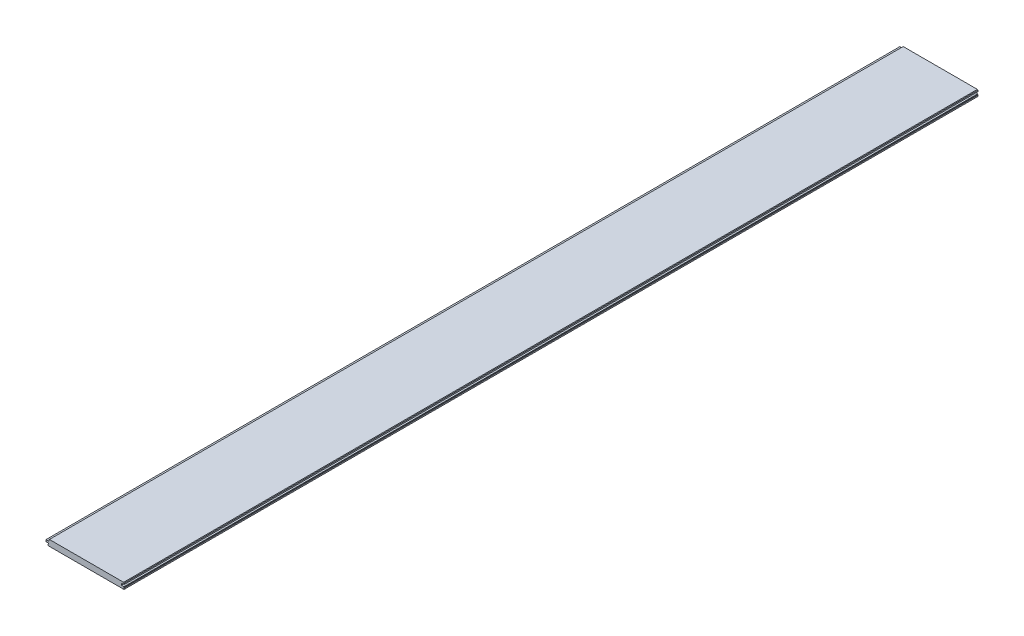
ISO-10303-21;
HEADER;
FILE_DESCRIPTION(('STEP AP214'),'2;1');
FILE_NAME('part.step','',(''),(''),'','','');
FILE_SCHEMA(('AUTOMOTIVE_DESIGN { 1 0 10303 214 1 1 1 1 }'));
ENDSEC;
DATA;
#1=APPLICATION_CONTEXT('core data for automotive mechanical design processes');
#2=APPLICATION_PROTOCOL_DEFINITION('international standard','automotive_design',2000,#1);
#3=PRODUCT_CONTEXT('',#1,'mechanical');
#4=PRODUCT('Part','Part','',(#3));
#5=PRODUCT_RELATED_PRODUCT_CATEGORY('part','',(#4));
#6=PRODUCT_DEFINITION_FORMATION('','',#4);
#7=PRODUCT_DEFINITION_CONTEXT('part definition',#1,'design');
#8=PRODUCT_DEFINITION('design','',#6,#7);
#9=PRODUCT_DEFINITION_SHAPE('','',#8);
#10=(LENGTH_UNIT() NAMED_UNIT(*) SI_UNIT(.MILLI.,.METRE.));
#11=(NAMED_UNIT(*) PLANE_ANGLE_UNIT() SI_UNIT($,.RADIAN.));
#12=(NAMED_UNIT(*) SI_UNIT($,.STERADIAN.) SOLID_ANGLE_UNIT());
#13=UNCERTAINTY_MEASURE_WITH_UNIT(LENGTH_MEASURE(1.E-05),#10,'distance_accuracy_value','');
#14=(GEOMETRIC_REPRESENTATION_CONTEXT(3) GLOBAL_UNCERTAINTY_ASSIGNED_CONTEXT((#13)) GLOBAL_UNIT_ASSIGNED_CONTEXT((#10,
#11,#12)) REPRESENTATION_CONTEXT('',''));
#15=CARTESIAN_POINT('',(0.,0.,0.));
#16=DIRECTION('',(0.,0.,1.));
#17=DIRECTION('',(1.,0.,0.));
#18=AXIS2_PLACEMENT_3D('',#15,#16,#17);
#19=CARTESIAN_POINT('',(94.83725,0.,1066.8));
#20=DIRECTION('',(-1.,0.,0.));
#21=DIRECTION('',(0.,0.,1.));
#22=AXIS2_PLACEMENT_3D('',#19,#20,#21);
#23=PLANE('',#22);
#24=DIRECTION('',(0.,1.,0.));
#25=VECTOR('',#24,1.);
#26=CARTESIAN_POINT('',(94.83725,0.,-1066.8));
#27=LINE('',#26,#25);
#28=CARTESIAN_POINT('',(94.83725,3.12419999999999,-1066.8));
#29=VERTEX_POINT('',#28);
#30=CARTESIAN_POINT('',(94.83725,6.28649999999999,-1066.8));
#31=VERTEX_POINT('',#30);
#32=EDGE_CURVE('E206',#29,#31,#27,.T.);
#33=ORIENTED_EDGE('',*,*,#32,.T.);
#34=DIRECTION('',(0.,0.,-1.));
#35=VECTOR('',#34,1.);
#36=CARTESIAN_POINT('',(94.83725,6.28649999999999,1066.8));
#37=LINE('',#36,#35);
#38=CARTESIAN_POINT('',(94.83725,6.28649999999999,1066.8));
#39=VERTEX_POINT('',#38);
#40=EDGE_CURVE('E11',#39,#31,#37,.T.);
#41=ORIENTED_EDGE('',*,*,#40,.F.);
#42=DIRECTION('',(0.,1.,0.));
#43=VECTOR('',#42,1.);
#44=CARTESIAN_POINT('',(94.83725,0.,1066.8));
#45=LINE('',#44,#43);
#46=CARTESIAN_POINT('',(94.83725,3.12419999999999,1066.8));
#47=VERTEX_POINT('',#46);
#48=EDGE_CURVE('E256',#47,#39,#45,.T.);
#49=ORIENTED_EDGE('',*,*,#48,.F.);
#50=DIRECTION('',(0.,0.,-1.));
#51=VECTOR('',#50,1.);
#52=CARTESIAN_POINT('',(94.83725,3.12419999999999,1066.8));
#53=LINE('',#52,#51);
#54=EDGE_CURVE('E53',#47,#29,#53,.T.);
#55=ORIENTED_EDGE('',*,*,#54,.T.);
#56=EDGE_LOOP('',(#33,#41,#49,#55));
#57=FACE_BOUND('',#56,.T.);
#58=ADVANCED_FACE('F37',(#57),#23,.F.);
#59=CARTESIAN_POINT('',(50.5618749999997,50.561875,1066.8));
#60=DIRECTION('',(-0.707106781186545,-0.707106781186549,0.));
#61=DIRECTION('',(0.70710678118655,-0.707106781186546,0.));
#62=AXIS2_PLACEMENT_3D('',#59,#60,#61);
#63=PLANE('',#62);
#64=DIRECTION('',(-0.70710678118655,0.707106781186546,0.));
#65=VECTOR('',#64,1.);
#66=CARTESIAN_POINT('',(50.5618749999997,50.561875,-1066.8));
#67=LINE('',#66,#65);
#68=CARTESIAN_POINT('',(93.56725,7.55649999999999,-1066.8));
#69=VERTEX_POINT('',#68);
#70=EDGE_CURVE('E208',#31,#69,#67,.T.);
#71=ORIENTED_EDGE('',*,*,#70,.T.);
#72=DIRECTION('',(0.,0.,-1.));
#73=VECTOR('',#72,1.);
#74=CARTESIAN_POINT('',(93.56725,7.55649999999999,1066.8));
#75=LINE('',#74,#73);
#76=CARTESIAN_POINT('',(93.56725,7.55649999999999,1066.8));
#77=VERTEX_POINT('',#76);
#78=EDGE_CURVE('E45',#77,#69,#75,.T.);
#79=ORIENTED_EDGE('',*,*,#78,.F.);
#80=DIRECTION('',(-0.70710678118655,0.707106781186546,0.));
#81=VECTOR('',#80,1.);
#82=CARTESIAN_POINT('',(50.5618749999997,50.561875,1066.8));
#83=LINE('',#82,#81);
#84=EDGE_CURVE('E127',#39,#77,#83,.T.);
#85=ORIENTED_EDGE('',*,*,#84,.F.);
#86=ORIENTED_EDGE('',*,*,#40,.T.);
#87=EDGE_LOOP('',(#71,#79,#85,#86));
#88=FACE_BOUND('',#87,.T.);
#89=ADVANCED_FACE('F299',(#88),#63,.F.);
#90=CARTESIAN_POINT('',(0.,7.55649999999999,1066.8));
#91=DIRECTION('',(0.,1.,0.));
#92=DIRECTION('',(0.,0.,1.));
#93=AXIS2_PLACEMENT_3D('',#90,#91,#92);
#94=PLANE('',#93);
#95=DIRECTION('',(1.,0.,0.));
#96=VECTOR('',#95,1.);
#97=CARTESIAN_POINT('',(0.,7.55649999999999,-1066.8));
#98=LINE('',#97,#96);
#99=CARTESIAN_POINT('',(-91.86545,7.55649999999999,-1066.8));
#100=VERTEX_POINT('',#99);
#101=EDGE_CURVE('E211',#100,#69,#98,.T.);
#102=ORIENTED_EDGE('',*,*,#101,.F.);
#103=DIRECTION('',(0.,0.,-1.));
#104=VECTOR('',#103,1.);
#105=CARTESIAN_POINT('',(-91.86545,7.55649999999999,1066.8));
#106=LINE('',#105,#104);
#107=CARTESIAN_POINT('',(-91.86545,7.55649999999999,1066.8));
#108=VERTEX_POINT('',#107);
#109=EDGE_CURVE('E292',#108,#100,#106,.T.);
#110=ORIENTED_EDGE('',*,*,#109,.F.);
#111=DIRECTION('',(1.,0.,0.));
#112=VECTOR('',#111,1.);
#113=CARTESIAN_POINT('',(0.,7.55649999999999,1066.8));
#114=LINE('',#113,#112);
#115=EDGE_CURVE('E298',#108,#77,#114,.T.);
#116=ORIENTED_EDGE('',*,*,#115,.T.);
#117=ORIENTED_EDGE('',*,*,#78,.T.);
#118=EDGE_LOOP('',(#102,#110,#116,#117));
#119=FACE_BOUND('',#118,.T.);
#120=ADVANCED_FACE('F296',(#119),#94,.T.);
#121=CARTESIAN_POINT('',(-49.7109749999998,49.710975,1066.8));
#122=DIRECTION('',(-0.707106781186545,0.707106781186549,0.));
#123=DIRECTION('',(-0.70710678118655,-0.707106781186546,0.));
#124=AXIS2_PLACEMENT_3D('',#121,#122,#123);
#125=PLANE('',#124);
#126=DIRECTION('',(0.70710678118655,0.707106781186546,0.));
#127=VECTOR('',#126,1.);
#128=CARTESIAN_POINT('',(-49.7109749999998,49.710975,-1066.8));
#129=LINE('',#128,#127);
#130=CARTESIAN_POINT('',(-93.13545,6.28649999999998,-1066.8));
#131=VERTEX_POINT('',#130);
#132=EDGE_CURVE('E214',#131,#100,#129,.T.);
#133=ORIENTED_EDGE('',*,*,#132,.F.);
#134=DIRECTION('',(0.,0.,-1.));
#135=VECTOR('',#134,1.);
#136=CARTESIAN_POINT('',(-93.13545,6.28649999999998,1066.8));
#137=LINE('',#136,#135);
#138=CARTESIAN_POINT('',(-93.13545,6.28649999999998,1066.8));
#139=VERTEX_POINT('',#138);
#140=EDGE_CURVE('E290',#139,#131,#137,.T.);
#141=ORIENTED_EDGE('',*,*,#140,.F.);
#142=DIRECTION('',(0.70710678118655,0.707106781186546,0.));
#143=VECTOR('',#142,1.);
#144=CARTESIAN_POINT('',(-49.7109749999998,49.710975,1066.8));
#145=LINE('',#144,#143);
#146=EDGE_CURVE('E310',#139,#108,#145,.T.);
#147=ORIENTED_EDGE('',*,*,#146,.T.);
#148=ORIENTED_EDGE('',*,*,#109,.T.);
#149=EDGE_LOOP('',(#133,#141,#147,#148));
#150=FACE_BOUND('',#149,.T.);
#151=ADVANCED_FACE('F307',(#150),#125,.T.);
#152=CARTESIAN_POINT('',(-93.13545,0.,1066.8));
#153=DIRECTION('',(-1.,0.,0.));
#154=DIRECTION('',(0.,0.,1.));
#155=AXIS2_PLACEMENT_3D('',#152,#153,#154);
#156=PLANE('',#155);
#157=DIRECTION('',(0.,1.,0.));
#158=VECTOR('',#157,1.);
#159=CARTESIAN_POINT('',(-93.13545,0.,-1066.8));
#160=LINE('',#159,#158);
#161=CARTESIAN_POINT('',(-93.13545,2.98449999999999,-1066.8));
#162=VERTEX_POINT('',#161);
#163=EDGE_CURVE('E217',#162,#131,#160,.T.);
#164=ORIENTED_EDGE('',*,*,#163,.F.);
#165=DIRECTION('',(0.,0.,-1.));
#166=VECTOR('',#165,1.);
#167=CARTESIAN_POINT('',(-93.13545,2.98449999999999,1066.8));
#168=LINE('',#167,#166);
#169=CARTESIAN_POINT('',(-93.13545,2.98449999999999,1066.8));
#170=VERTEX_POINT('',#169);
#171=EDGE_CURVE('E288',#170,#162,#168,.T.);
#172=ORIENTED_EDGE('',*,*,#171,.F.);
#173=DIRECTION('',(0.,1.,0.));
#174=VECTOR('',#173,1.);
#175=CARTESIAN_POINT('',(-93.13545,0.,1066.8));
#176=LINE('',#175,#174);
#177=EDGE_CURVE('E314',#170,#139,#176,.T.);
#178=ORIENTED_EDGE('',*,*,#177,.T.);
#179=ORIENTED_EDGE('',*,*,#140,.T.);
#180=EDGE_LOOP('',(#164,#172,#178,#179));
#181=FACE_BOUND('',#180,.T.);
#182=ADVANCED_FACE('F369',(#181),#156,.T.);
#183=CARTESIAN_POINT('',(0.,2.98450000000001,1066.8));
#184=DIRECTION('',(0.,-1.,0.));
#185=DIRECTION('',(1.,0.,0.));
#186=AXIS2_PLACEMENT_3D('',#183,#184,#185);
#187=PLANE('',#186);
#188=DIRECTION('',(-1.,0.,0.));
#189=VECTOR('',#188,1.);
#190=CARTESIAN_POINT('',(0.,2.98450000000001,-1066.8));
#191=LINE('',#190,#189);
#192=CARTESIAN_POINT('',(-100.37445,2.98449999999999,-1066.8));
#193=VERTEX_POINT('',#192);
#194=EDGE_CURVE('E220',#162,#193,#191,.T.);
#195=ORIENTED_EDGE('',*,*,#194,.T.);
#196=DIRECTION('',(0.,0.,-1.));
#197=VECTOR('',#196,1.);
#198=CARTESIAN_POINT('',(-100.37445,2.98449999999999,1066.8));
#199=LINE('',#198,#197);
#200=CARTESIAN_POINT('',(-100.37445,2.98449999999999,1066.8));
#201=VERTEX_POINT('',#200);
#202=EDGE_CURVE('E285',#201,#193,#199,.T.);
#203=ORIENTED_EDGE('',*,*,#202,.F.);
#204=DIRECTION('',(-1.,0.,0.));
#205=VECTOR('',#204,1.);
#206=CARTESIAN_POINT('',(0.,2.98450000000001,1066.8));
#207=LINE('',#206,#205);
#208=EDGE_CURVE('E320',#170,#201,#207,.T.);
#209=ORIENTED_EDGE('',*,*,#208,.F.);
#210=ORIENTED_EDGE('',*,*,#171,.T.);
#211=EDGE_LOOP('',(#195,#203,#209,#210));
#212=FACE_BOUND('',#211,.T.);
#213=ADVANCED_FACE('F372',(#212),#187,.F.);
#214=CARTESIAN_POINT('',(-100.37445,0.,1066.8));
#215=DIRECTION('',(1.,0.,0.));
#216=DIRECTION('',(0.,0.,-1.));
#217=AXIS2_PLACEMENT_3D('',#214,#215,#216);
#218=PLANE('',#217);
#219=DIRECTION('',(0.,-1.,0.));
#220=VECTOR('',#219,1.);
#221=CARTESIAN_POINT('',(-100.37445,0.,-1066.8));
#222=LINE('',#221,#220);
#223=CARTESIAN_POINT('',(-100.37445,-1.58750000000001,-1066.8));
#224=VERTEX_POINT('',#223);
#225=EDGE_CURVE('E222',#193,#224,#222,.T.);
#226=ORIENTED_EDGE('',*,*,#225,.T.);
#227=DIRECTION('',(0.,0.,-1.));
#228=VECTOR('',#227,1.);
#229=CARTESIAN_POINT('',(-100.37445,-1.58750000000001,1066.8));
#230=LINE('',#229,#228);
#231=CARTESIAN_POINT('',(-100.37445,-1.58750000000001,1066.8));
#232=VERTEX_POINT('',#231);
#233=EDGE_CURVE('E282',#232,#224,#230,.T.);
#234=ORIENTED_EDGE('',*,*,#233,.F.);
#235=DIRECTION('',(0.,-1.,0.));
#236=VECTOR('',#235,1.);
#237=CARTESIAN_POINT('',(-100.37445,0.,1066.8));
#238=LINE('',#237,#236);
#239=EDGE_CURVE('E322',#201,#232,#238,.T.);
#240=ORIENTED_EDGE('',*,*,#239,.F.);
#241=ORIENTED_EDGE('',*,*,#202,.T.);
#242=EDGE_LOOP('',(#226,#234,#240,#241));
#243=FACE_BOUND('',#242,.T.);
#244=ADVANCED_FACE('F376',(#243),#218,.F.);
#245=CARTESIAN_POINT('',(0.,-1.58750000000001,1066.8));
#246=DIRECTION('',(0.,1.,0.));
#247=DIRECTION('',(0.,0.,1.));
#248=AXIS2_PLACEMENT_3D('',#245,#246,#247);
#249=PLANE('',#248);
#250=DIRECTION('',(1.,0.,0.));
#251=VECTOR('',#250,1.);
#252=CARTESIAN_POINT('',(0.,-1.58750000000001,-1066.8));
#253=LINE('',#252,#251);
#254=CARTESIAN_POINT('',(-94.53245,-1.58750000000001,-1066.8));
#255=VERTEX_POINT('',#254);
#256=EDGE_CURVE('E224',#224,#255,#253,.T.);
#257=ORIENTED_EDGE('',*,*,#256,.T.);
#258=DIRECTION('',(0.,0.,-1.));
#259=VECTOR('',#258,1.);
#260=CARTESIAN_POINT('',(-94.53245,-1.58750000000001,1066.8));
#261=LINE('',#260,#259);
#262=CARTESIAN_POINT('',(-94.53245,-1.58750000000001,1066.8));
#263=VERTEX_POINT('',#262);
#264=EDGE_CURVE('E279',#263,#255,#261,.T.);
#265=ORIENTED_EDGE('',*,*,#264,.F.);
#266=DIRECTION('',(1.,0.,0.));
#267=VECTOR('',#266,1.);
#268=CARTESIAN_POINT('',(0.,-1.58750000000001,1066.8));
#269=LINE('',#268,#267);
#270=EDGE_CURVE('E324',#232,#263,#269,.T.);
#271=ORIENTED_EDGE('',*,*,#270,.F.);
#272=ORIENTED_EDGE('',*,*,#233,.T.);
#273=EDGE_LOOP('',(#257,#265,#271,#272));
#274=FACE_BOUND('',#273,.T.);
#275=ADVANCED_FACE('F380',(#274),#249,.F.);
#276=CARTESIAN_POINT('',(-94.53245,0.,1066.8));
#277=DIRECTION('',(1.,0.,0.));
#278=DIRECTION('',(0.,0.,-1.));
#279=AXIS2_PLACEMENT_3D('',#276,#277,#278);
#280=PLANE('',#279);
#281=DIRECTION('',(0.,-1.,0.));
#282=VECTOR('',#281,1.);
#283=CARTESIAN_POINT('',(-94.53245,0.,-1066.8));
#284=LINE('',#283,#282);
#285=CARTESIAN_POINT('',(-94.53245,-3.11149999999999,-1066.8));
#286=VERTEX_POINT('',#285);
#287=EDGE_CURVE('E226',#255,#286,#284,.T.);
#288=ORIENTED_EDGE('',*,*,#287,.T.);
#289=DIRECTION('',(0.,0.,-1.));
#290=VECTOR('',#289,1.);
#291=CARTESIAN_POINT('',(-94.53245,-3.11149999999999,1066.8));
#292=LINE('',#291,#290);
#293=CARTESIAN_POINT('',(-94.53245,-3.11149999999999,1066.8));
#294=VERTEX_POINT('',#293);
#295=EDGE_CURVE('E276',#294,#286,#292,.T.);
#296=ORIENTED_EDGE('',*,*,#295,.F.);
#297=DIRECTION('',(0.,-1.,0.));
#298=VECTOR('',#297,1.);
#299=CARTESIAN_POINT('',(-94.53245,0.,1066.8));
#300=LINE('',#299,#298);
#301=EDGE_CURVE('E326',#263,#294,#300,.T.);
#302=ORIENTED_EDGE('',*,*,#301,.F.);
#303=ORIENTED_EDGE('',*,*,#264,.T.);
#304=EDGE_LOOP('',(#288,#296,#302,#303));
#305=FACE_BOUND('',#304,.T.);
#306=ADVANCED_FACE('F384',(#305),#280,.F.);
#307=CARTESIAN_POINT('',(-45.7104750000013,45.7104750000001,1066.8));
#308=DIRECTION('',(0.707106781186557,-0.707106781186538,0.));
#309=DIRECTION('',(0.707106781186538,0.707106781186557,0.));
#310=AXIS2_PLACEMENT_3D('',#307,#308,#309);
#311=PLANE('',#310);
#312=DIRECTION('',(-0.707106781186538,-0.707106781186557,0.));
#313=VECTOR('',#312,1.);
#314=CARTESIAN_POINT('',(-45.7104750000013,45.7104750000001,-1066.8));
#315=LINE('',#314,#313);
#316=CARTESIAN_POINT('',(-95.16745,-3.74650000000001,-1066.8));
#317=VERTEX_POINT('',#316);
#318=EDGE_CURVE('E228',#286,#317,#315,.T.);
#319=ORIENTED_EDGE('',*,*,#318,.T.);
#320=DIRECTION('',(0.,0.,-1.));
#321=VECTOR('',#320,1.);
#322=CARTESIAN_POINT('',(-95.16745,-3.74650000000001,1066.8));
#323=LINE('',#322,#321);
#324=CARTESIAN_POINT('',(-95.16745,-3.74650000000001,1066.8));
#325=VERTEX_POINT('',#324);
#326=EDGE_CURVE('E273',#325,#317,#323,.T.);
#327=ORIENTED_EDGE('',*,*,#326,.F.);
#328=DIRECTION('',(-0.707106781186538,-0.707106781186557,0.));
#329=VECTOR('',#328,1.);
#330=CARTESIAN_POINT('',(-45.7104750000013,45.7104750000001,1066.8));
#331=LINE('',#330,#329);
#332=EDGE_CURVE('E328',#294,#325,#331,.T.);
#333=ORIENTED_EDGE('',*,*,#332,.F.);
#334=ORIENTED_EDGE('',*,*,#295,.T.);
#335=EDGE_LOOP('',(#319,#327,#333,#334));
#336=FACE_BOUND('',#335,.T.);
#337=ADVANCED_FACE('F388',(#336),#311,.F.);
#338=CARTESIAN_POINT('',(-95.16745,0.,1066.8));
#339=DIRECTION('',(1.,0.,0.));
#340=DIRECTION('',(0.,0.,-1.));
#341=AXIS2_PLACEMENT_3D('',#338,#339,#340);
#342=PLANE('',#341);
#343=DIRECTION('',(0.,-1.,0.));
#344=VECTOR('',#343,1.);
#345=CARTESIAN_POINT('',(-95.16745,0.,-1066.8));
#346=LINE('',#345,#344);
#347=CARTESIAN_POINT('',(-95.16745,-6.92150000000001,-1066.8));
#348=VERTEX_POINT('',#347);
#349=EDGE_CURVE('E230',#317,#348,#346,.T.);
#350=ORIENTED_EDGE('',*,*,#349,.T.);
#351=DIRECTION('',(0.,0.,-1.));
#352=VECTOR('',#351,1.);
#353=CARTESIAN_POINT('',(-95.16745,-6.92150000000001,1066.8));
#354=LINE('',#353,#352);
#355=CARTESIAN_POINT('',(-95.16745,-6.92150000000001,1066.8));
#356=VERTEX_POINT('',#355);
#357=EDGE_CURVE('E271',#356,#348,#354,.T.);
#358=ORIENTED_EDGE('',*,*,#357,.F.);
#359=DIRECTION('',(0.,-1.,0.));
#360=VECTOR('',#359,1.);
#361=CARTESIAN_POINT('',(-95.16745,0.,1066.8));
#362=LINE('',#361,#360);
#363=EDGE_CURVE('E330',#325,#356,#362,.T.);
#364=ORIENTED_EDGE('',*,*,#363,.F.);
#365=ORIENTED_EDGE('',*,*,#326,.T.);
#366=EDGE_LOOP('',(#350,#358,#364,#365));
#367=FACE_BOUND('',#366,.T.);
#368=ADVANCED_FACE('F392',(#367),#342,.F.);
#369=CARTESIAN_POINT('',(-51.0444749999992,-51.0444750000001,1066.8));
#370=DIRECTION('',(-0.707106781186542,-0.707106781186553,0.));
#371=DIRECTION('',(0.707106781186553,-0.707106781186542,0.));
#372=AXIS2_PLACEMENT_3D('',#369,#370,#371);
#373=PLANE('',#372);
#374=DIRECTION('',(-0.707106781186553,0.707106781186542,0.));
#375=VECTOR('',#374,1.);
#376=CARTESIAN_POINT('',(-51.0444749999992,-51.0444750000001,-1066.8));
#377=LINE('',#376,#375);
#378=CARTESIAN_POINT('',(-94.53245,-7.55650000000001,-1066.8));
#379=VERTEX_POINT('',#378);
#380=EDGE_CURVE('E233',#379,#348,#377,.T.);
#381=ORIENTED_EDGE('',*,*,#380,.F.);
#382=DIRECTION('',(0.,0.,-1.));
#383=VECTOR('',#382,1.);
#384=CARTESIAN_POINT('',(-94.53245,-7.55650000000001,1066.8));
#385=LINE('',#384,#383);
#386=CARTESIAN_POINT('',(-94.53245,-7.55650000000001,1066.8));
#387=VERTEX_POINT('',#386);
#388=EDGE_CURVE('E269',#387,#379,#385,.T.);
#389=ORIENTED_EDGE('',*,*,#388,.F.);
#390=DIRECTION('',(-0.707106781186553,0.707106781186542,0.));
#391=VECTOR('',#390,1.);
#392=CARTESIAN_POINT('',(-51.0444749999992,-51.0444750000001,1066.8));
#393=LINE('',#392,#391);
#394=EDGE_CURVE('E332',#387,#356,#393,.T.);
#395=ORIENTED_EDGE('',*,*,#394,.T.);
#396=ORIENTED_EDGE('',*,*,#357,.T.);
#397=EDGE_LOOP('',(#381,#389,#395,#396));
#398=FACE_BOUND('',#397,.T.);
#399=ADVANCED_FACE('F396',(#398),#373,.T.);
#400=CARTESIAN_POINT('',(0.,-7.55650000000001,1066.8));
#401=DIRECTION('',(0.,1.,0.));
#402=DIRECTION('',(0.,0.,1.));
#403=AXIS2_PLACEMENT_3D('',#400,#401,#402);
#404=PLANE('',#403);
#405=DIRECTION('',(1.,0.,0.));
#406=VECTOR('',#405,1.);
#407=CARTESIAN_POINT('',(0.,-7.55650000000001,-1066.8));
#408=LINE('',#407,#406);
#409=CARTESIAN_POINT('',(94.53245,-7.5565,-1066.8));
#410=VERTEX_POINT('',#409);
#411=EDGE_CURVE('E236',#379,#410,#408,.T.);
#412=ORIENTED_EDGE('',*,*,#411,.T.);
#413=DIRECTION('',(0.,0.,-1.));
#414=VECTOR('',#413,1.);
#415=CARTESIAN_POINT('',(94.53245,-7.5565,1066.8));
#416=LINE('',#415,#414);
#417=CARTESIAN_POINT('',(94.53245,-7.5565,1066.8));
#418=VERTEX_POINT('',#417);
#419=EDGE_CURVE('E266',#418,#410,#416,.T.);
#420=ORIENTED_EDGE('',*,*,#419,.F.);
#421=DIRECTION('',(1.,0.,0.));
#422=VECTOR('',#421,1.);
#423=CARTESIAN_POINT('',(0.,-7.55650000000001,1066.8));
#424=LINE('',#423,#422);
#425=EDGE_CURVE('E335',#387,#418,#424,.T.);
#426=ORIENTED_EDGE('',*,*,#425,.F.);
#427=ORIENTED_EDGE('',*,*,#388,.T.);
#428=EDGE_LOOP('',(#412,#420,#426,#427));
#429=FACE_BOUND('',#428,.T.);
#430=ADVANCED_FACE('F400',(#429),#404,.F.);
#431=CARTESIAN_POINT('',(51.0444750000007,-51.044475,1066.8));
#432=DIRECTION('',(-0.707106781186552,0.707106781186543,0.));
#433=DIRECTION('',(-0.707106781186543,-0.707106781186552,0.));
#434=AXIS2_PLACEMENT_3D('',#431,#432,#433);
#435=PLANE('',#434);
#436=DIRECTION('',(0.707106781186543,0.707106781186552,0.));
#437=VECTOR('',#436,1.);
#438=CARTESIAN_POINT('',(51.0444750000007,-51.044475,-1066.8));
#439=LINE('',#438,#437);
#440=CARTESIAN_POINT('',(95.16745,-6.92150000000001,-1066.8));
#441=VERTEX_POINT('',#440);
#442=EDGE_CURVE('E238',#410,#441,#439,.T.);
#443=ORIENTED_EDGE('',*,*,#442,.T.);
#444=DIRECTION('',(0.,0.,-1.));
#445=VECTOR('',#444,1.);
#446=CARTESIAN_POINT('',(95.16745,-6.92150000000001,1066.8));
#447=LINE('',#446,#445);
#448=CARTESIAN_POINT('',(95.16745,-6.92150000000001,1066.8));
#449=VERTEX_POINT('',#448);
#450=EDGE_CURVE('E264',#449,#441,#447,.T.);
#451=ORIENTED_EDGE('',*,*,#450,.F.);
#452=DIRECTION('',(0.707106781186543,0.707106781186552,0.));
#453=VECTOR('',#452,1.);
#454=CARTESIAN_POINT('',(51.0444750000007,-51.044475,1066.8));
#455=LINE('',#454,#453);
#456=EDGE_CURVE('E337',#418,#449,#455,.T.);
#457=ORIENTED_EDGE('',*,*,#456,.F.);
#458=ORIENTED_EDGE('',*,*,#419,.T.);
#459=EDGE_LOOP('',(#443,#451,#457,#458));
#460=FACE_BOUND('',#459,.T.);
#461=ADVANCED_FACE('F404',(#460),#435,.F.);
#462=CARTESIAN_POINT('',(95.16745,0.,1066.8));
#463=DIRECTION('',(1.,0.,0.));
#464=DIRECTION('',(0.,0.,-1.));
#465=AXIS2_PLACEMENT_3D('',#462,#463,#464);
#466=PLANE('',#465);
#467=DIRECTION('',(0.,-1.,0.));
#468=VECTOR('',#467,1.);
#469=CARTESIAN_POINT('',(95.16745,0.,-1066.8));
#470=LINE('',#469,#468);
#471=CARTESIAN_POINT('',(95.16745,-3.74650000000002,-1066.8));
#472=VERTEX_POINT('',#471);
#473=EDGE_CURVE('E241',#472,#441,#470,.T.);
#474=ORIENTED_EDGE('',*,*,#473,.F.);
#475=DIRECTION('',(0.,0.,-1.));
#476=VECTOR('',#475,1.);
#477=CARTESIAN_POINT('',(95.16745,-3.74650000000002,1066.8));
#478=LINE('',#477,#476);
#479=CARTESIAN_POINT('',(95.16745,-3.74650000000002,1066.8));
#480=VERTEX_POINT('',#479);
#481=EDGE_CURVE('E262',#480,#472,#478,.T.);
#482=ORIENTED_EDGE('',*,*,#481,.F.);
#483=DIRECTION('',(0.,-1.,0.));
#484=VECTOR('',#483,1.);
#485=CARTESIAN_POINT('',(95.16745,0.,1066.8));
#486=LINE('',#485,#484);
#487=EDGE_CURVE('E339',#480,#449,#486,.T.);
#488=ORIENTED_EDGE('',*,*,#487,.T.);
#489=ORIENTED_EDGE('',*,*,#450,.T.);
#490=EDGE_LOOP('',(#474,#482,#488,#489));
#491=FACE_BOUND('',#490,.T.);
#492=ADVANCED_FACE('F408',(#491),#466,.T.);
#493=CARTESIAN_POINT('',(45.7104750000007,45.710475,1066.8));
#494=DIRECTION('',(0.707106781186553,0.707106781186542,0.));
#495=DIRECTION('',(-0.707106781186542,0.707106781186553,0.));
#496=AXIS2_PLACEMENT_3D('',#493,#494,#495);
#497=PLANE('',#496);
#498=DIRECTION('',(0.707106781186542,-0.707106781186553,0.));
#499=VECTOR('',#498,1.);
#500=CARTESIAN_POINT('',(45.7104750000007,45.710475,-1066.8));
#501=LINE('',#500,#499);
#502=CARTESIAN_POINT('',(94.53245,-3.1115,-1066.8));
#503=VERTEX_POINT('',#502);
#504=EDGE_CURVE('E244',#503,#472,#501,.T.);
#505=ORIENTED_EDGE('',*,*,#504,.F.);
#506=DIRECTION('',(0.,0.,-1.));
#507=VECTOR('',#506,1.);
#508=CARTESIAN_POINT('',(94.53245,-3.1115,1066.8));
#509=LINE('',#508,#507);
#510=CARTESIAN_POINT('',(94.53245,-3.1115,1066.8));
#511=VERTEX_POINT('',#510);
#512=EDGE_CURVE('E260',#511,#503,#509,.T.);
#513=ORIENTED_EDGE('',*,*,#512,.F.);
#514=DIRECTION('',(0.707106781186542,-0.707106781186553,0.));
#515=VECTOR('',#514,1.);
#516=CARTESIAN_POINT('',(45.7104750000007,45.710475,1066.8));
#517=LINE('',#516,#515);
#518=EDGE_CURVE('E342',#511,#480,#517,.T.);
#519=ORIENTED_EDGE('',*,*,#518,.T.);
#520=ORIENTED_EDGE('',*,*,#481,.T.);
#521=EDGE_LOOP('',(#505,#513,#519,#520));
#522=FACE_BOUND('',#521,.T.);
#523=ADVANCED_FACE('F412',(#522),#497,.T.);
#524=CARTESIAN_POINT('',(94.53245,0.,1066.8));
#525=DIRECTION('',(1.,0.,0.));
#526=DIRECTION('',(0.,0.,-1.));
#527=AXIS2_PLACEMENT_3D('',#524,#525,#526);
#528=PLANE('',#527);
#529=DIRECTION('',(0.,-1.,0.));
#530=VECTOR('',#529,1.);
#531=CARTESIAN_POINT('',(94.53245,0.,-1066.8));
#532=LINE('',#531,#530);
#533=CARTESIAN_POINT('',(94.53245,-1.49860000000001,-1066.8));
#534=VERTEX_POINT('',#533);
#535=EDGE_CURVE('E247',#534,#503,#532,.T.);
#536=ORIENTED_EDGE('',*,*,#535,.F.);
#537=DIRECTION('',(0.,0.,-1.));
#538=VECTOR('',#537,1.);
#539=CARTESIAN_POINT('',(94.53245,-1.49860000000001,1066.8));
#540=LINE('',#539,#538);
#541=CARTESIAN_POINT('',(94.53245,-1.49860000000001,1066.8));
#542=VERTEX_POINT('',#541);
#543=EDGE_CURVE('E188',#542,#534,#540,.T.);
#544=ORIENTED_EDGE('',*,*,#543,.F.);
#545=DIRECTION('',(0.,-1.,0.));
#546=VECTOR('',#545,1.);
#547=CARTESIAN_POINT('',(94.53245,0.,1066.8));
#548=LINE('',#547,#546);
#549=EDGE_CURVE('E198',#542,#511,#548,.T.);
#550=ORIENTED_EDGE('',*,*,#549,.T.);
#551=ORIENTED_EDGE('',*,*,#512,.T.);
#552=EDGE_LOOP('',(#536,#544,#550,#551));
#553=FACE_BOUND('',#552,.T.);
#554=ADVANCED_FACE('F346',(#553),#528,.T.);
#555=CARTESIAN_POINT('',(0.,-1.49860000000001,1066.8));
#556=DIRECTION('',(0.,1.,0.));
#557=DIRECTION('',(0.,0.,1.));
#558=AXIS2_PLACEMENT_3D('',#555,#556,#557);
#559=PLANE('',#558);
#560=DIRECTION('',(1.,0.,0.));
#561=VECTOR('',#560,1.);
#562=CARTESIAN_POINT('',(0.,-1.49860000000001,-1066.8));
#563=LINE('',#562,#561);
#564=CARTESIAN_POINT('',(87.91575,-1.49860000000001,-1066.8));
#565=VERTEX_POINT('',#564);
#566=EDGE_CURVE('E184',#565,#534,#563,.T.);
#567=ORIENTED_EDGE('',*,*,#566,.F.);
#568=DIRECTION('',(0.,0.,-1.));
#569=VECTOR('',#568,1.);
#570=CARTESIAN_POINT('',(87.91575,-1.49860000000001,1066.8));
#571=LINE('',#570,#569);
#572=CARTESIAN_POINT('',(87.91575,-1.49860000000001,1066.8));
#573=VERTEX_POINT('',#572);
#574=EDGE_CURVE('E179',#573,#565,#571,.T.);
#575=ORIENTED_EDGE('',*,*,#574,.F.);
#576=DIRECTION('',(1.,0.,0.));
#577=VECTOR('',#576,1.);
#578=CARTESIAN_POINT('',(0.,-1.49860000000001,1066.8));
#579=LINE('',#578,#577);
#580=EDGE_CURVE('E182',#573,#542,#579,.T.);
#581=ORIENTED_EDGE('',*,*,#580,.T.);
#582=ORIENTED_EDGE('',*,*,#543,.T.);
#583=EDGE_LOOP('',(#567,#575,#581,#582));
#584=FACE_BOUND('',#583,.T.);
#585=ADVANCED_FACE('F181',(#584),#559,.T.);
#586=CARTESIAN_POINT('',(87.91575,0.,1066.8));
#587=DIRECTION('',(1.,0.,0.));
#588=DIRECTION('',(0.,0.,-1.));
#589=AXIS2_PLACEMENT_3D('',#586,#587,#588);
#590=PLANE('',#589);
#591=DIRECTION('',(0.,-1.,0.));
#592=VECTOR('',#591,1.);
#593=CARTESIAN_POINT('',(87.91575,0.,-1066.8));
#594=LINE('',#593,#592);
#595=CARTESIAN_POINT('',(87.91575,3.12419999999999,-1066.8));
#596=VERTEX_POINT('',#595);
#597=EDGE_CURVE('E251',#596,#565,#594,.T.);
#598=ORIENTED_EDGE('',*,*,#597,.F.);
#599=DIRECTION('',(0.,0.,-1.));
#600=VECTOR('',#599,1.);
#601=CARTESIAN_POINT('',(87.91575,3.12419999999999,1066.8));
#602=LINE('',#601,#600);
#603=CARTESIAN_POINT('',(87.91575,3.12419999999999,1066.8));
#604=VERTEX_POINT('',#603);
#605=EDGE_CURVE('E115',#604,#596,#602,.T.);
#606=ORIENTED_EDGE('',*,*,#605,.F.);
#607=DIRECTION('',(0.,-1.,0.));
#608=VECTOR('',#607,1.);
#609=CARTESIAN_POINT('',(87.91575,0.,1066.8));
#610=LINE('',#609,#608);
#611=EDGE_CURVE('E195',#604,#573,#610,.T.);
#612=ORIENTED_EDGE('',*,*,#611,.T.);
#613=ORIENTED_EDGE('',*,*,#574,.T.);
#614=EDGE_LOOP('',(#598,#606,#612,#613));
#615=FACE_BOUND('',#614,.T.);
#616=ADVANCED_FACE('F200',(#615),#590,.T.);
#617=CARTESIAN_POINT('',(0.,3.12419999999998,1066.8));
#618=DIRECTION('',(0.,-1.,0.));
#619=DIRECTION('',(1.,0.,0.));
#620=AXIS2_PLACEMENT_3D('',#617,#618,#619);
#621=PLANE('',#620);
#622=DIRECTION('',(-1.,0.,0.));
#623=VECTOR('',#622,1.);
#624=CARTESIAN_POINT('',(0.,3.12419999999998,-1066.8));
#625=LINE('',#624,#623);
#626=EDGE_CURVE('E253',#29,#596,#625,.T.);
#627=ORIENTED_EDGE('',*,*,#626,.F.);
#628=ORIENTED_EDGE('',*,*,#54,.F.);
#629=DIRECTION('',(-1.,0.,0.));
#630=VECTOR('',#629,1.);
#631=CARTESIAN_POINT('',(0.,3.12419999999998,1066.8));
#632=LINE('',#631,#630);
#633=EDGE_CURVE('E201',#47,#604,#632,.T.);
#634=ORIENTED_EDGE('',*,*,#633,.T.);
#635=ORIENTED_EDGE('',*,*,#605,.T.);
#636=EDGE_LOOP('',(#627,#628,#634,#635));
#637=FACE_BOUND('',#636,.T.);
#638=ADVANCED_FACE('F348',(#637),#621,.T.);
#639=CARTESIAN_POINT('',(0.,0.,1066.8));
#640=DIRECTION('',(0.,0.,1.));
#641=DIRECTION('',(1.,0.,0.));
#642=AXIS2_PLACEMENT_3D('',#639,#640,#641);
#643=PLANE('',#642);
#644=ORIENTED_EDGE('',*,*,#48,.T.);
#645=ORIENTED_EDGE('',*,*,#84,.T.);
#646=ORIENTED_EDGE('',*,*,#115,.F.);
#647=ORIENTED_EDGE('',*,*,#146,.F.);
#648=ORIENTED_EDGE('',*,*,#177,.F.);
#649=ORIENTED_EDGE('',*,*,#208,.T.);
#650=ORIENTED_EDGE('',*,*,#239,.T.);
#651=ORIENTED_EDGE('',*,*,#270,.T.);
#652=ORIENTED_EDGE('',*,*,#301,.T.);
#653=ORIENTED_EDGE('',*,*,#332,.T.);
#654=ORIENTED_EDGE('',*,*,#363,.T.);
#655=ORIENTED_EDGE('',*,*,#394,.F.);
#656=ORIENTED_EDGE('',*,*,#425,.T.);
#657=ORIENTED_EDGE('',*,*,#456,.T.);
#658=ORIENTED_EDGE('',*,*,#487,.F.);
#659=ORIENTED_EDGE('',*,*,#518,.F.);
#660=ORIENTED_EDGE('',*,*,#549,.F.);
#661=ORIENTED_EDGE('',*,*,#580,.F.);
#662=ORIENTED_EDGE('',*,*,#611,.F.);
#663=ORIENTED_EDGE('',*,*,#633,.F.);
#664=EDGE_LOOP('',(#644,#645,#646,#647,#648,#649,#650,#651,#652,#653,#654,#655,#656,#657,#658,
#659,#660,#661,#662,#663));
#665=FACE_BOUND('',#664,.T.);
#666=ADVANCED_FACE('F193',(#665),#643,.T.);
#667=CARTESIAN_POINT('',(0.,0.,-1066.8));
#668=DIRECTION('',(0.,0.,1.));
#669=DIRECTION('',(1.,0.,0.));
#670=AXIS2_PLACEMENT_3D('',#667,#668,#669);
#671=PLANE('',#670);
#672=ORIENTED_EDGE('',*,*,#32,.F.);
#673=ORIENTED_EDGE('',*,*,#626,.T.);
#674=ORIENTED_EDGE('',*,*,#597,.T.);
#675=ORIENTED_EDGE('',*,*,#566,.T.);
#676=ORIENTED_EDGE('',*,*,#535,.T.);
#677=ORIENTED_EDGE('',*,*,#504,.T.);
#678=ORIENTED_EDGE('',*,*,#473,.T.);
#679=ORIENTED_EDGE('',*,*,#442,.F.);
#680=ORIENTED_EDGE('',*,*,#411,.F.);
#681=ORIENTED_EDGE('',*,*,#380,.T.);
#682=ORIENTED_EDGE('',*,*,#349,.F.);
#683=ORIENTED_EDGE('',*,*,#318,.F.);
#684=ORIENTED_EDGE('',*,*,#287,.F.);
#685=ORIENTED_EDGE('',*,*,#256,.F.);
#686=ORIENTED_EDGE('',*,*,#225,.F.);
#687=ORIENTED_EDGE('',*,*,#194,.F.);
#688=ORIENTED_EDGE('',*,*,#163,.T.);
#689=ORIENTED_EDGE('',*,*,#132,.T.);
#690=ORIENTED_EDGE('',*,*,#101,.T.);
#691=ORIENTED_EDGE('',*,*,#70,.F.);
#692=EDGE_LOOP('',(#672,#673,#674,#675,#676,#677,#678,#679,#680,#681,#682,#683,#684,#685,#686,
#687,#688,#689,#690,#691));
#693=FACE_BOUND('',#692,.T.);
#694=ADVANCED_FACE('F302',(#693),#671,.F.);
#695=CLOSED_SHELL('',(#58,#89,#120,#151,#182,#213,#244,#275,#306,#337,#368,#399,#430,#461,#492,
#523,#554,#585,#616,#638,#666,#694));
#696=MANIFOLD_SOLID_BREP('B2',#695);
#697=ADVANCED_BREP_SHAPE_REPRESENTATION('',(#18,#696),#14);
#698=SHAPE_DEFINITION_REPRESENTATION(#9,#697);
ENDSEC;
END-ISO-10303-21;
